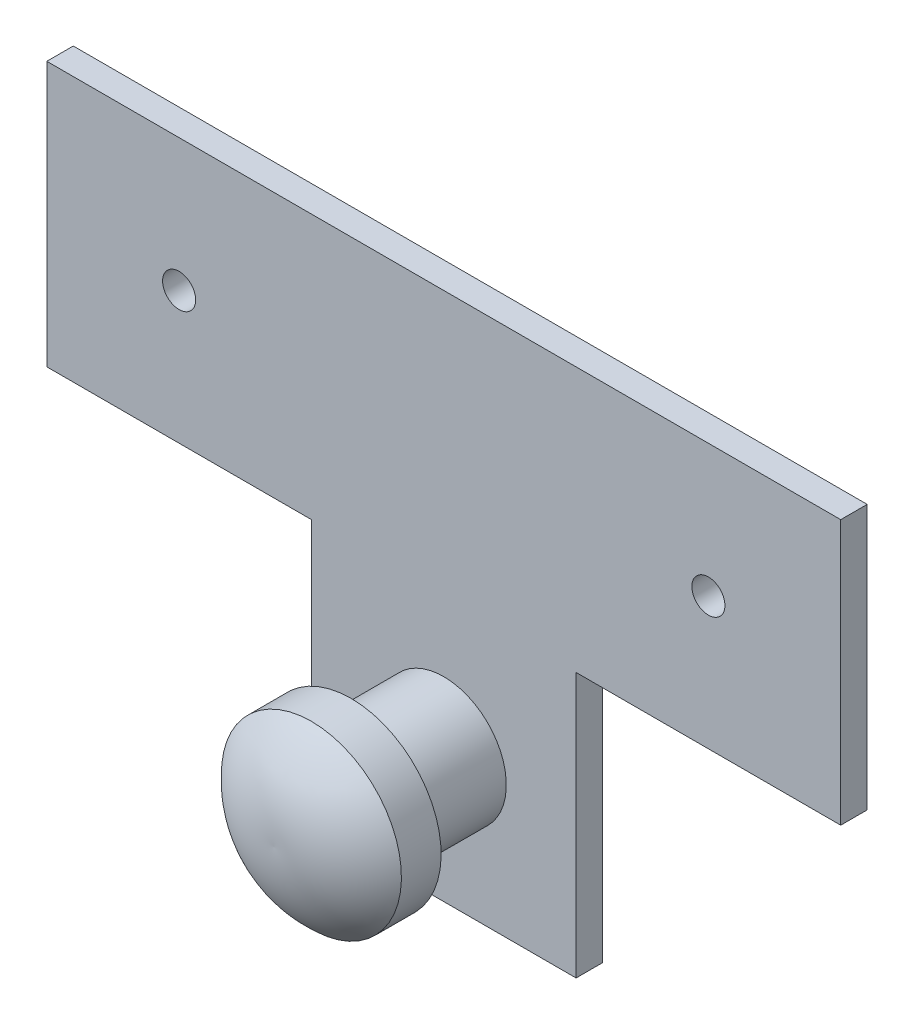
ISO-10303-21;
HEADER;
FILE_DESCRIPTION(('STEP AP214'),'2;1');
FILE_NAME('part.step','',(''),(''),'','','');
FILE_SCHEMA(('AUTOMOTIVE_DESIGN { 1 0 10303 214 1 1 1 1 }'));
ENDSEC;
DATA;
#1=APPLICATION_CONTEXT('core data for automotive mechanical design processes');
#2=APPLICATION_PROTOCOL_DEFINITION('international standard','automotive_design',2000,#1);
#3=PRODUCT_CONTEXT('',#1,'mechanical');
#4=PRODUCT('Part','Part','',(#3));
#5=PRODUCT_RELATED_PRODUCT_CATEGORY('part','',(#4));
#6=PRODUCT_DEFINITION_FORMATION('','',#4);
#7=PRODUCT_DEFINITION_CONTEXT('part definition',#1,'design');
#8=PRODUCT_DEFINITION('design','',#6,#7);
#9=PRODUCT_DEFINITION_SHAPE('','',#8);
#10=(LENGTH_UNIT() NAMED_UNIT(*) SI_UNIT(.MILLI.,.METRE.));
#11=(NAMED_UNIT(*) PLANE_ANGLE_UNIT() SI_UNIT($,.RADIAN.));
#12=(NAMED_UNIT(*) SI_UNIT($,.STERADIAN.) SOLID_ANGLE_UNIT());
#13=UNCERTAINTY_MEASURE_WITH_UNIT(LENGTH_MEASURE(1.E-05),#10,'distance_accuracy_value','');
#14=(GEOMETRIC_REPRESENTATION_CONTEXT(3) GLOBAL_UNCERTAINTY_ASSIGNED_CONTEXT((#13)) GLOBAL_UNIT_ASSIGNED_CONTEXT((#10,
#11,#12)) REPRESENTATION_CONTEXT('',''));
#15=CARTESIAN_POINT('',(0.,0.,0.));
#16=DIRECTION('',(0.,0.,1.));
#17=DIRECTION('',(1.,0.,0.));
#18=AXIS2_PLACEMENT_3D('',#15,#16,#17);
#19=CARTESIAN_POINT('',(-38.1,0.,2.54));
#20=DIRECTION('',(0.,1.,0.));
#21=DIRECTION('',(0.,0.,1.));
#22=AXIS2_PLACEMENT_3D('',#19,#20,#21);
#23=PLANE('',#22);
#24=DIRECTION('',(1.,0.,0.));
#25=VECTOR('',#24,1.);
#26=CARTESIAN_POINT('',(-38.1,0.,0.));
#27=LINE('',#26,#25);
#28=CARTESIAN_POINT('',(-38.1,0.,0.));
#29=VERTEX_POINT('',#28);
#30=CARTESIAN_POINT('',(-12.7,0.,0.));
#31=VERTEX_POINT('',#30);
#32=EDGE_CURVE('E135',#29,#31,#27,.T.);
#33=ORIENTED_EDGE('',*,*,#32,.T.);
#34=DIRECTION('',(0.,0.,-1.));
#35=VECTOR('',#34,1.);
#36=CARTESIAN_POINT('',(-12.7,0.,2.54));
#37=LINE('',#36,#35);
#38=CARTESIAN_POINT('',(-12.7,0.,2.54));
#39=VERTEX_POINT('',#38);
#40=EDGE_CURVE('E44',#39,#31,#37,.T.);
#41=ORIENTED_EDGE('',*,*,#40,.F.);
#42=DIRECTION('',(1.,0.,0.));
#43=VECTOR('',#42,1.);
#44=CARTESIAN_POINT('',(-38.1,0.,2.54));
#45=LINE('',#44,#43);
#46=CARTESIAN_POINT('',(-38.1,0.,2.54));
#47=VERTEX_POINT('',#46);
#48=EDGE_CURVE('E150',#47,#39,#45,.T.);
#49=ORIENTED_EDGE('',*,*,#48,.F.);
#50=DIRECTION('',(0.,0.,-1.));
#51=VECTOR('',#50,1.);
#52=CARTESIAN_POINT('',(-38.1,0.,2.54));
#53=LINE('',#52,#51);
#54=EDGE_CURVE('E131',#47,#29,#53,.T.);
#55=ORIENTED_EDGE('',*,*,#54,.T.);
#56=EDGE_LOOP('',(#33,#41,#49,#55));
#57=FACE_BOUND('',#56,.T.);
#58=ADVANCED_FACE('F36',(#57),#23,.F.);
#59=CARTESIAN_POINT('',(-12.7,0.,2.54));
#60=DIRECTION('',(1.,0.,0.));
#61=DIRECTION('',(0.,1.,0.));
#62=AXIS2_PLACEMENT_3D('',#59,#60,#61);
#63=PLANE('',#62);
#64=DIRECTION('',(0.,-1.,0.));
#65=VECTOR('',#64,1.);
#66=CARTESIAN_POINT('',(-12.7,0.,0.));
#67=LINE('',#66,#65);
#68=CARTESIAN_POINT('',(-12.7,-25.4,0.));
#69=VERTEX_POINT('',#68);
#70=EDGE_CURVE('E138',#31,#69,#67,.T.);
#71=ORIENTED_EDGE('',*,*,#70,.T.);
#72=DIRECTION('',(0.,0.,-1.));
#73=VECTOR('',#72,1.);
#74=CARTESIAN_POINT('',(-12.7,-25.4,2.54));
#75=LINE('',#74,#73);
#76=CARTESIAN_POINT('',(-12.7,-25.4,2.54));
#77=VERTEX_POINT('',#76);
#78=EDGE_CURVE('E160',#77,#69,#75,.T.);
#79=ORIENTED_EDGE('',*,*,#78,.F.);
#80=DIRECTION('',(0.,-1.,0.));
#81=VECTOR('',#80,1.);
#82=CARTESIAN_POINT('',(-12.7,0.,2.54));
#83=LINE('',#82,#81);
#84=EDGE_CURVE('E97',#39,#77,#83,.T.);
#85=ORIENTED_EDGE('',*,*,#84,.F.);
#86=ORIENTED_EDGE('',*,*,#40,.T.);
#87=EDGE_LOOP('',(#71,#79,#85,#86));
#88=FACE_BOUND('',#87,.T.);
#89=ADVANCED_FACE('F163',(#88),#63,.F.);
#90=CARTESIAN_POINT('',(-12.7,-25.4,2.54));
#91=DIRECTION('',(0.,1.,0.));
#92=DIRECTION('',(0.,0.,1.));
#93=AXIS2_PLACEMENT_3D('',#90,#91,#92);
#94=PLANE('',#93);
#95=DIRECTION('',(1.,0.,0.));
#96=VECTOR('',#95,1.);
#97=CARTESIAN_POINT('',(-12.7,-25.4,0.));
#98=LINE('',#97,#96);
#99=CARTESIAN_POINT('',(12.7,-25.4,0.));
#100=VERTEX_POINT('',#99);
#101=EDGE_CURVE('E141',#69,#100,#98,.T.);
#102=ORIENTED_EDGE('',*,*,#101,.T.);
#103=DIRECTION('',(0.,0.,-1.));
#104=VECTOR('',#103,1.);
#105=CARTESIAN_POINT('',(12.7,-25.4,2.54));
#106=LINE('',#105,#104);
#107=CARTESIAN_POINT('',(12.7,-25.4,2.54));
#108=VERTEX_POINT('',#107);
#109=EDGE_CURVE('E157',#108,#100,#106,.T.);
#110=ORIENTED_EDGE('',*,*,#109,.F.);
#111=DIRECTION('',(1.,0.,0.));
#112=VECTOR('',#111,1.);
#113=CARTESIAN_POINT('',(-12.7,-25.4,2.54));
#114=LINE('',#113,#112);
#115=EDGE_CURVE('E181',#77,#108,#114,.T.);
#116=ORIENTED_EDGE('',*,*,#115,.F.);
#117=ORIENTED_EDGE('',*,*,#78,.T.);
#118=EDGE_LOOP('',(#102,#110,#116,#117));
#119=FACE_BOUND('',#118,.T.);
#120=ADVANCED_FACE('F174',(#119),#94,.F.);
#121=CARTESIAN_POINT('',(12.7,0.,2.54));
#122=DIRECTION('',(-1.,0.,0.));
#123=DIRECTION('',(0.,-1.,0.));
#124=AXIS2_PLACEMENT_3D('',#121,#122,#123);
#125=PLANE('',#124);
#126=DIRECTION('',(0.,1.,0.));
#127=VECTOR('',#126,1.);
#128=CARTESIAN_POINT('',(12.7,0.,0.));
#129=LINE('',#128,#127);
#130=CARTESIAN_POINT('',(12.7,0.,0.));
#131=VERTEX_POINT('',#130);
#132=EDGE_CURVE('E143',#100,#131,#129,.T.);
#133=ORIENTED_EDGE('',*,*,#132,.T.);
#134=DIRECTION('',(0.,0.,-1.));
#135=VECTOR('',#134,1.);
#136=CARTESIAN_POINT('',(12.7,0.,2.54));
#137=LINE('',#136,#135);
#138=CARTESIAN_POINT('',(12.7,0.,2.54));
#139=VERTEX_POINT('',#138);
#140=EDGE_CURVE('E154',#139,#131,#137,.T.);
#141=ORIENTED_EDGE('',*,*,#140,.F.);
#142=DIRECTION('',(0.,1.,0.));
#143=VECTOR('',#142,1.);
#144=CARTESIAN_POINT('',(12.7,0.,2.54));
#145=LINE('',#144,#143);
#146=EDGE_CURVE('E180',#108,#139,#145,.T.);
#147=ORIENTED_EDGE('',*,*,#146,.F.);
#148=ORIENTED_EDGE('',*,*,#109,.T.);
#149=EDGE_LOOP('',(#133,#141,#147,#148));
#150=FACE_BOUND('',#149,.T.);
#151=ADVANCED_FACE('F178',(#150),#125,.F.);
#152=CARTESIAN_POINT('',(12.7,0.,2.54));
#153=DIRECTION('',(0.,1.,0.));
#154=DIRECTION('',(-1.,0.,0.));
#155=AXIS2_PLACEMENT_3D('',#152,#153,#154);
#156=PLANE('',#155);
#157=DIRECTION('',(1.,0.,0.));
#158=VECTOR('',#157,1.);
#159=CARTESIAN_POINT('',(12.7,0.,0.));
#160=LINE('',#159,#158);
#161=CARTESIAN_POINT('',(38.1,0.,0.));
#162=VERTEX_POINT('',#161);
#163=EDGE_CURVE('E145',#131,#162,#160,.T.);
#164=ORIENTED_EDGE('',*,*,#163,.T.);
#165=DIRECTION('',(0.,0.,-1.));
#166=VECTOR('',#165,1.);
#167=CARTESIAN_POINT('',(38.1,0.,2.54));
#168=LINE('',#167,#166);
#169=CARTESIAN_POINT('',(38.1,0.,2.54));
#170=VERTEX_POINT('',#169);
#171=EDGE_CURVE('E126',#170,#162,#168,.T.);
#172=ORIENTED_EDGE('',*,*,#171,.F.);
#173=DIRECTION('',(1.,0.,0.));
#174=VECTOR('',#173,1.);
#175=CARTESIAN_POINT('',(12.7,0.,2.54));
#176=LINE('',#175,#174);
#177=EDGE_CURVE('E117',#139,#170,#176,.T.);
#178=ORIENTED_EDGE('',*,*,#177,.F.);
#179=ORIENTED_EDGE('',*,*,#140,.T.);
#180=EDGE_LOOP('',(#164,#172,#178,#179));
#181=FACE_BOUND('',#180,.T.);
#182=ADVANCED_FACE('F254',(#181),#156,.F.);
#183=CARTESIAN_POINT('',(38.1,25.4,2.54));
#184=DIRECTION('',(-1.,0.,0.));
#185=DIRECTION('',(0.,0.,1.));
#186=AXIS2_PLACEMENT_3D('',#183,#184,#185);
#187=PLANE('',#186);
#188=DIRECTION('',(0.,1.,0.));
#189=VECTOR('',#188,1.);
#190=CARTESIAN_POINT('',(38.1,25.4,0.));
#191=LINE('',#190,#189);
#192=CARTESIAN_POINT('',(38.1,25.4,0.));
#193=VERTEX_POINT('',#192);
#194=EDGE_CURVE('E125',#162,#193,#191,.T.);
#195=ORIENTED_EDGE('',*,*,#194,.T.);
#196=DIRECTION('',(0.,0.,-1.));
#197=VECTOR('',#196,1.);
#198=CARTESIAN_POINT('',(38.1,25.4,2.54));
#199=LINE('',#198,#197);
#200=CARTESIAN_POINT('',(38.1,25.4,2.54));
#201=VERTEX_POINT('',#200);
#202=EDGE_CURVE('E122',#201,#193,#199,.T.);
#203=ORIENTED_EDGE('',*,*,#202,.F.);
#204=DIRECTION('',(0.,1.,0.));
#205=VECTOR('',#204,1.);
#206=CARTESIAN_POINT('',(38.1,25.4,2.54));
#207=LINE('',#206,#205);
#208=EDGE_CURVE('E111',#170,#201,#207,.T.);
#209=ORIENTED_EDGE('',*,*,#208,.F.);
#210=ORIENTED_EDGE('',*,*,#171,.T.);
#211=EDGE_LOOP('',(#195,#203,#209,#210));
#212=FACE_BOUND('',#211,.T.);
#213=ADVANCED_FACE('F123',(#212),#187,.F.);
#214=CARTESIAN_POINT('',(-38.1,25.4,2.54));
#215=DIRECTION('',(0.,-1.,0.));
#216=DIRECTION('',(1.,0.,0.));
#217=AXIS2_PLACEMENT_3D('',#214,#215,#216);
#218=PLANE('',#217);
#219=DIRECTION('',(-1.,0.,0.));
#220=VECTOR('',#219,1.);
#221=CARTESIAN_POINT('',(-38.1,25.4,0.));
#222=LINE('',#221,#220);
#223=CARTESIAN_POINT('',(-38.1,25.4,0.));
#224=VERTEX_POINT('',#223);
#225=EDGE_CURVE('E82',#193,#224,#222,.T.);
#226=ORIENTED_EDGE('',*,*,#225,.T.);
#227=DIRECTION('',(0.,0.,-1.));
#228=VECTOR('',#227,1.);
#229=CARTESIAN_POINT('',(-38.1,25.4,2.54));
#230=LINE('',#229,#228);
#231=CARTESIAN_POINT('',(-38.1,25.4,2.54));
#232=VERTEX_POINT('',#231);
#233=EDGE_CURVE('E127',#232,#224,#230,.T.);
#234=ORIENTED_EDGE('',*,*,#233,.F.);
#235=DIRECTION('',(-1.,0.,0.));
#236=VECTOR('',#235,1.);
#237=CARTESIAN_POINT('',(-38.1,25.4,2.54));
#238=LINE('',#237,#236);
#239=EDGE_CURVE('E115',#201,#232,#238,.T.);
#240=ORIENTED_EDGE('',*,*,#239,.F.);
#241=ORIENTED_EDGE('',*,*,#202,.T.);
#242=EDGE_LOOP('',(#226,#234,#240,#241));
#243=FACE_BOUND('',#242,.T.);
#244=ADVANCED_FACE('F129',(#243),#218,.F.);
#245=CARTESIAN_POINT('',(-38.1,25.4,2.54));
#246=DIRECTION('',(1.,0.,0.));
#247=DIRECTION('',(0.,0.,-1.));
#248=AXIS2_PLACEMENT_3D('',#245,#246,#247);
#249=PLANE('',#248);
#250=DIRECTION('',(0.,-1.,0.));
#251=VECTOR('',#250,1.);
#252=CARTESIAN_POINT('',(-38.1,25.4,0.));
#253=LINE('',#252,#251);
#254=EDGE_CURVE('E88',#224,#29,#253,.T.);
#255=ORIENTED_EDGE('',*,*,#254,.T.);
#256=ORIENTED_EDGE('',*,*,#54,.F.);
#257=DIRECTION('',(0.,-1.,0.));
#258=VECTOR('',#257,1.);
#259=CARTESIAN_POINT('',(-38.1,25.4,2.54));
#260=LINE('',#259,#258);
#261=EDGE_CURVE('E52',#232,#47,#260,.T.);
#262=ORIENTED_EDGE('',*,*,#261,.F.);
#263=ORIENTED_EDGE('',*,*,#233,.T.);
#264=EDGE_LOOP('',(#255,#256,#262,#263));
#265=FACE_BOUND('',#264,.T.);
#266=ADVANCED_FACE('F226',(#265),#249,.F.);
#267=CARTESIAN_POINT('',(0.,0.,2.54));
#268=DIRECTION('',(0.,0.,-1.));
#269=DIRECTION('',(-1.,0.,0.));
#270=AXIS2_PLACEMENT_3D('',#267,#268,#269);
#271=PLANE('',#270);
#272=CARTESIAN_POINT('',(-25.4,12.7,2.54));
#273=DIRECTION('',(0.,0.,-1.));
#274=DIRECTION('',(-1.,0.,0.));
#275=AXIS2_PLACEMENT_3D('',#272,#273,#274);
#276=CIRCLE('',#275,1.5875);
#277=CARTESIAN_POINT('',(-26.9875,12.7,2.54));
#278=VERTEX_POINT('',#277);
#279=EDGE_CURVE('E195',#278,#278,#276,.F.);
#280=ORIENTED_EDGE('',*,*,#279,.F.);
#281=EDGE_LOOP('',(#280));
#282=FACE_BOUND('',#281,.T.);
#283=CARTESIAN_POINT('',(25.4,12.7,2.54));
#284=DIRECTION('',(0.,0.,-1.));
#285=DIRECTION('',(-1.,0.,0.));
#286=AXIS2_PLACEMENT_3D('',#283,#284,#285);
#287=CIRCLE('',#286,1.5875);
#288=CARTESIAN_POINT('',(23.8125,12.7,2.54));
#289=VERTEX_POINT('',#288);
#290=EDGE_CURVE('E196',#289,#289,#287,.F.);
#291=ORIENTED_EDGE('',*,*,#290,.F.);
#292=EDGE_LOOP('',(#291));
#293=FACE_BOUND('',#292,.T.);
#294=CARTESIAN_POINT('',(0.,-12.7,2.54));
#295=DIRECTION('',(0.,0.,-1.));
#296=DIRECTION('',(-1.,0.,0.));
#297=AXIS2_PLACEMENT_3D('',#294,#295,#296);
#298=CIRCLE('',#297,6.);
#299=CARTESIAN_POINT('',(-6.,-12.7,2.54));
#300=VERTEX_POINT('',#299);
#301=EDGE_CURVE('E11',#300,#300,#298,.F.);
#302=ORIENTED_EDGE('',*,*,#301,.F.);
#303=EDGE_LOOP('',(#302));
#304=FACE_BOUND('',#303,.T.);
#305=ORIENTED_EDGE('',*,*,#48,.T.);
#306=ORIENTED_EDGE('',*,*,#84,.T.);
#307=ORIENTED_EDGE('',*,*,#115,.T.);
#308=ORIENTED_EDGE('',*,*,#146,.T.);
#309=ORIENTED_EDGE('',*,*,#177,.T.);
#310=ORIENTED_EDGE('',*,*,#208,.T.);
#311=ORIENTED_EDGE('',*,*,#239,.T.);
#312=ORIENTED_EDGE('',*,*,#261,.T.);
#313=EDGE_LOOP('',(#305,#306,#307,#308,#309,#310,#311,#312));
#314=FACE_BOUND('',#313,.T.);
#315=ADVANCED_FACE('F113',(#282,#293,#304,#314),#271,.F.);
#316=CARTESIAN_POINT('',(0.,0.,0.));
#317=DIRECTION('',(0.,0.,-1.));
#318=DIRECTION('',(-1.,0.,0.));
#319=AXIS2_PLACEMENT_3D('',#316,#317,#318);
#320=PLANE('',#319);
#321=CARTESIAN_POINT('',(-25.4,12.7,0.));
#322=DIRECTION('',(0.,0.,-1.));
#323=DIRECTION('',(-1.,0.,0.));
#324=AXIS2_PLACEMENT_3D('',#321,#322,#323);
#325=CIRCLE('',#324,1.5875);
#326=CARTESIAN_POINT('',(-26.9875,12.7,0.));
#327=VERTEX_POINT('',#326);
#328=EDGE_CURVE('E199',#327,#327,#325,.T.);
#329=ORIENTED_EDGE('',*,*,#328,.F.);
#330=EDGE_LOOP('',(#329));
#331=FACE_BOUND('',#330,.T.);
#332=CARTESIAN_POINT('',(25.4,12.7,0.));
#333=DIRECTION('',(0.,0.,-1.));
#334=DIRECTION('',(-1.,0.,0.));
#335=AXIS2_PLACEMENT_3D('',#332,#333,#334);
#336=CIRCLE('',#335,1.5875);
#337=CARTESIAN_POINT('',(23.8125,12.7,0.));
#338=VERTEX_POINT('',#337);
#339=EDGE_CURVE('E200',#338,#338,#336,.T.);
#340=ORIENTED_EDGE('',*,*,#339,.F.);
#341=EDGE_LOOP('',(#340));
#342=FACE_BOUND('',#341,.T.);
#343=ORIENTED_EDGE('',*,*,#32,.F.);
#344=ORIENTED_EDGE('',*,*,#254,.F.);
#345=ORIENTED_EDGE('',*,*,#225,.F.);
#346=ORIENTED_EDGE('',*,*,#194,.F.);
#347=ORIENTED_EDGE('',*,*,#163,.F.);
#348=ORIENTED_EDGE('',*,*,#132,.F.);
#349=ORIENTED_EDGE('',*,*,#101,.F.);
#350=ORIENTED_EDGE('',*,*,#70,.F.);
#351=EDGE_LOOP('',(#343,#344,#345,#346,#347,#348,#349,#350));
#352=FACE_BOUND('',#351,.T.);
#353=ADVANCED_FACE('F168',(#331,#342,#352),#320,.T.);
#354=CARTESIAN_POINT('',(0.,-12.7,11.43));
#355=DIRECTION('',(0.,0.,-1.));
#356=DIRECTION('',(-1.,0.,0.));
#357=AXIS2_PLACEMENT_3D('',#354,#355,#356);
#358=CYLINDRICAL_SURFACE('',#357,6.);
#359=CARTESIAN_POINT('',(0.,-12.7,11.43));
#360=DIRECTION('',(0.,0.,1.));
#361=DIRECTION('',(1.,0.,0.));
#362=AXIS2_PLACEMENT_3D('',#359,#360,#361);
#363=CIRCLE('',#362,6.);
#364=CARTESIAN_POINT('',(6.,-12.7,11.43));
#365=VERTEX_POINT('',#364);
#366=EDGE_CURVE('E139',#365,#365,#363,.T.);
#367=ORIENTED_EDGE('',*,*,#366,.F.);
#368=EDGE_LOOP('',(#367));
#369=FACE_BOUND('',#368,.T.);
#370=ORIENTED_EDGE('',*,*,#301,.T.);
#371=EDGE_LOOP('',(#370));
#372=FACE_BOUND('',#371,.T.);
#373=ADVANCED_FACE('F213',(#369,#372),#358,.T.);
#374=CARTESIAN_POINT('',(0.,-12.7,11.43));
#375=DIRECTION('',(0.,0.,1.));
#376=DIRECTION('',(0.,-1.,0.));
#377=AXIS2_PLACEMENT_3D('',#374,#375,#376);
#378=PLANE('',#377);
#379=ORIENTED_EDGE('',*,*,#366,.T.);
#380=EDGE_LOOP('',(#379));
#381=FACE_BOUND('',#380,.T.);
#382=CARTESIAN_POINT('',(0.,-12.7,11.43));
#383=DIRECTION('',(0.,0.,-1.));
#384=DIRECTION('',(0.,1.,0.));
#385=AXIS2_PLACEMENT_3D('',#382,#383,#384);
#386=CIRCLE('',#385,8.636);
#387=CARTESIAN_POINT('',(0.,-4.064,11.43));
#388=VERTEX_POINT('',#387);
#389=EDGE_CURVE('E189',#388,#388,#386,.T.);
#390=ORIENTED_EDGE('',*,*,#389,.T.);
#391=EDGE_LOOP('',(#390));
#392=FACE_BOUND('',#391,.T.);
#393=ADVANCED_FACE('F232',(#381,#392),#378,.F.);
#394=CARTESIAN_POINT('',(0.,-12.7,11.43));
#395=DIRECTION('',(0.,0.,-1.));
#396=DIRECTION('',(0.,1.,0.));
#397=AXIS2_PLACEMENT_3D('',#394,#395,#396);
#398=CYLINDRICAL_SURFACE('',#397,8.636);
#399=ORIENTED_EDGE('',*,*,#389,.F.);
#400=EDGE_LOOP('',(#399));
#401=FACE_BOUND('',#400,.T.);
#402=CARTESIAN_POINT('',(0.,-12.7,15.24));
#403=DIRECTION('',(0.,0.,-1.));
#404=DIRECTION('',(0.,1.,0.));
#405=AXIS2_PLACEMENT_3D('',#402,#403,#404);
#406=CIRCLE('',#405,8.636);
#407=CARTESIAN_POINT('',(0.,-4.064,15.24));
#408=VERTEX_POINT('',#407);
#409=EDGE_CURVE('E192',#408,#408,#406,.T.);
#410=ORIENTED_EDGE('',*,*,#409,.T.);
#411=EDGE_LOOP('',(#410));
#412=FACE_BOUND('',#411,.T.);
#413=ADVANCED_FACE('F239',(#401,#412),#398,.T.);
#414=CARTESIAN_POINT('',(0.,-12.086782483635,8.19560971114671));
#415=DIRECTION('',(-1.,0.,0.));
#416=DIRECTION('',(0.,1.,0.));
#417=AXIS2_PLACEMENT_3D('',#414,#415,#416);
#418=CIRCLE('',#417,10.676538452205);
#419=TRIMMED_CURVE('',#418,(PARAMETER_VALUE(-1.62826393926617)),
(PARAMETER_VALUE(1.62826393926617)),.T.,.PARAMETER.);
#420=CARTESIAN_POINT('',(0.,-12.7,8.19560971114671));
#421=DIRECTION('',(0.,0.,-1.));
#422=AXIS1_PLACEMENT('',#420,#421);
#423=SURFACE_OF_REVOLUTION('',#419,#422);
#424=ORIENTED_EDGE('',*,*,#409,.F.);
#425=EDGE_LOOP('',(#424));
#426=FACE_BOUND('',#425,.T.);
#427=CARTESIAN_POINT('',(0.,-12.7,18.8545232392242));
#428=VERTEX_POINT('',#427);
#429=VERTEX_LOOP('',#428);
#430=FACE_BOUND('',#429,.T.);
#431=ADVANCED_FACE('F220',(#426,#430),#423,.T.);
#432=CARTESIAN_POINT('',(25.4,12.7,18.8731481633517));
#433=DIRECTION('',(0.,0.,-1.));
#434=DIRECTION('',(-1.,0.,0.));
#435=AXIS2_PLACEMENT_3D('',#432,#433,#434);
#436=CYLINDRICAL_SURFACE('',#435,1.5875);
#437=ORIENTED_EDGE('',*,*,#339,.T.);
#438=EDGE_LOOP('',(#437));
#439=FACE_BOUND('',#438,.T.);
#440=ORIENTED_EDGE('',*,*,#290,.T.);
#441=EDGE_LOOP('',(#440));
#442=FACE_BOUND('',#441,.T.);
#443=ADVANCED_FACE('F217',(#439,#442),#436,.F.);
#444=CARTESIAN_POINT('',(-25.4,12.7,18.8731481633517));
#445=DIRECTION('',(0.,0.,-1.));
#446=DIRECTION('',(-1.,0.,0.));
#447=AXIS2_PLACEMENT_3D('',#444,#445,#446);
#448=CYLINDRICAL_SURFACE('',#447,1.5875);
#449=ORIENTED_EDGE('',*,*,#328,.T.);
#450=EDGE_LOOP('',(#449));
#451=FACE_BOUND('',#450,.T.);
#452=ORIENTED_EDGE('',*,*,#279,.T.);
#453=EDGE_LOOP('',(#452));
#454=FACE_BOUND('',#453,.T.);
#455=ADVANCED_FACE('F208',(#451,#454),#448,.F.);
#456=CLOSED_SHELL('',(#58,#89,#120,#151,#182,#213,#244,#266,#315,#353,#373,#393,#413,#431,#443,#455));
#457=MANIFOLD_SOLID_BREP('B2',#456);
#458=ADVANCED_BREP_SHAPE_REPRESENTATION('',(#18,#457),#14);
#459=SHAPE_DEFINITION_REPRESENTATION(#9,#458);
ENDSEC;
END-ISO-10303-21;
